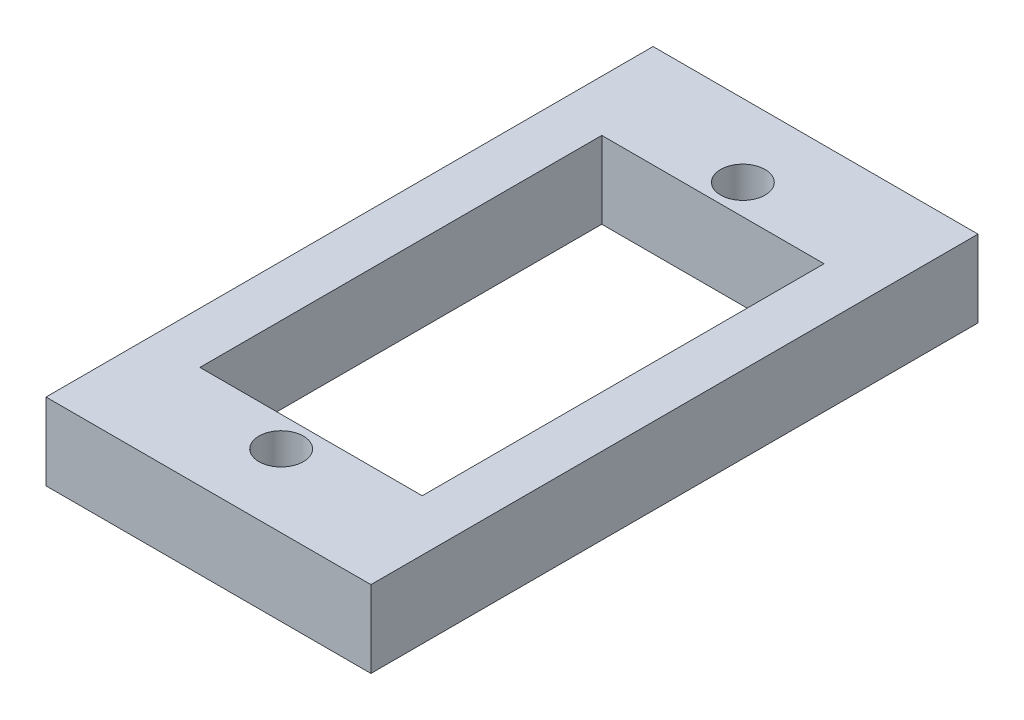
ISO-10303-21;
HEADER;
FILE_DESCRIPTION(('STEP AP214'),'2;1');
FILE_NAME('part.step','',(''),(''),'','','');
FILE_SCHEMA(('AUTOMOTIVE_DESIGN { 1 0 10303 214 1 1 1 1 }'));
ENDSEC;
DATA;
#1=APPLICATION_CONTEXT('core data for automotive mechanical design processes');
#2=APPLICATION_PROTOCOL_DEFINITION('international standard','automotive_design',2000,#1);
#3=PRODUCT_CONTEXT('',#1,'mechanical');
#4=PRODUCT('Part','Part','',(#3));
#5=PRODUCT_RELATED_PRODUCT_CATEGORY('part','',(#4));
#6=PRODUCT_DEFINITION_FORMATION('','',#4);
#7=PRODUCT_DEFINITION_CONTEXT('part definition',#1,'design');
#8=PRODUCT_DEFINITION('design','',#6,#7);
#9=PRODUCT_DEFINITION_SHAPE('','',#8);
#10=(LENGTH_UNIT() NAMED_UNIT(*) SI_UNIT(.MILLI.,.METRE.));
#11=(NAMED_UNIT(*) PLANE_ANGLE_UNIT() SI_UNIT($,.RADIAN.));
#12=(NAMED_UNIT(*) SI_UNIT($,.STERADIAN.) SOLID_ANGLE_UNIT());
#13=UNCERTAINTY_MEASURE_WITH_UNIT(LENGTH_MEASURE(1.E-05),#10,'distance_accuracy_value','');
#14=(GEOMETRIC_REPRESENTATION_CONTEXT(3) GLOBAL_UNCERTAINTY_ASSIGNED_CONTEXT((#13)) GLOBAL_UNIT_ASSIGNED_CONTEXT((#10,
#11,#12)) REPRESENTATION_CONTEXT('',''));
#15=CARTESIAN_POINT('',(0.,0.,0.));
#16=DIRECTION('',(0.,0.,1.));
#17=DIRECTION('',(1.,0.,0.));
#18=AXIS2_PLACEMENT_3D('',#15,#16,#17);
#19=CARTESIAN_POINT('',(0.,4.5,0.));
#20=DIRECTION('',(0.,-1.,0.));
#21=DIRECTION('',(0.,0.,-1.));
#22=AXIS2_PLACEMENT_3D('',#19,#20,#21);
#23=PLANE('',#22);
#24=DIRECTION('',(0.,0.,-1.));
#25=VECTOR('',#24,1.);
#26=CARTESIAN_POINT('',(9.5,4.5,17.75));
#27=LINE('',#26,#25);
#28=CARTESIAN_POINT('',(9.5,4.5,17.75));
#29=VERTEX_POINT('',#28);
#30=CARTESIAN_POINT('',(9.5,4.5,-17.75));
#31=VERTEX_POINT('',#30);
#32=EDGE_CURVE('E141',#29,#31,#27,.T.);
#33=ORIENTED_EDGE('',*,*,#32,.T.);
#34=DIRECTION('',(-1.,0.,0.));
#35=VECTOR('',#34,1.);
#36=CARTESIAN_POINT('',(-9.5,4.5,-17.75));
#37=LINE('',#36,#35);
#38=CARTESIAN_POINT('',(-9.5,4.5,-17.75));
#39=VERTEX_POINT('',#38);
#40=EDGE_CURVE('E144',#31,#39,#37,.T.);
#41=ORIENTED_EDGE('',*,*,#40,.T.);
#42=DIRECTION('',(0.,0.,1.));
#43=VECTOR('',#42,1.);
#44=CARTESIAN_POINT('',(-9.5,4.5,17.75));
#45=LINE('',#44,#43);
#46=CARTESIAN_POINT('',(-9.5,4.5,17.75));
#47=VERTEX_POINT('',#46);
#48=EDGE_CURVE('E147',#39,#47,#45,.T.);
#49=ORIENTED_EDGE('',*,*,#48,.T.);
#50=DIRECTION('',(1.,0.,0.));
#51=VECTOR('',#50,1.);
#52=CARTESIAN_POINT('',(-9.5,4.5,17.75));
#53=LINE('',#52,#51);
#54=EDGE_CURVE('E149',#47,#29,#53,.T.);
#55=ORIENTED_EDGE('',*,*,#54,.T.);
#56=EDGE_LOOP('',(#33,#41,#49,#55));
#57=FACE_BOUND('',#56,.T.);
#58=DIRECTION('',(0.,0.,-1.));
#59=VECTOR('',#58,1.);
#60=CARTESIAN_POINT('',(6.5,4.5,11.75));
#61=LINE('',#60,#59);
#62=CARTESIAN_POINT('',(6.5,4.5,11.75));
#63=VERTEX_POINT('',#62);
#64=CARTESIAN_POINT('',(6.5,4.5,-11.75));
#65=VERTEX_POINT('',#64);
#66=EDGE_CURVE('E102',#63,#65,#61,.T.);
#67=ORIENTED_EDGE('',*,*,#66,.F.);
#68=DIRECTION('',(1.,0.,0.));
#69=VECTOR('',#68,1.);
#70=CARTESIAN_POINT('',(-6.5,4.5,11.75));
#71=LINE('',#70,#69);
#72=CARTESIAN_POINT('',(-6.5,4.5,11.75));
#73=VERTEX_POINT('',#72);
#74=EDGE_CURVE('E125',#73,#63,#71,.T.);
#75=ORIENTED_EDGE('',*,*,#74,.F.);
#76=DIRECTION('',(0.,0.,1.));
#77=VECTOR('',#76,1.);
#78=CARTESIAN_POINT('',(-6.5,4.5,11.75));
#79=LINE('',#78,#77);
#80=CARTESIAN_POINT('',(-6.5,4.5,-11.75));
#81=VERTEX_POINT('',#80);
#82=EDGE_CURVE('E123',#81,#73,#79,.T.);
#83=ORIENTED_EDGE('',*,*,#82,.F.);
#84=DIRECTION('',(-1.,0.,0.));
#85=VECTOR('',#84,1.);
#86=CARTESIAN_POINT('',(-6.5,4.5,-11.75));
#87=LINE('',#86,#85);
#88=EDGE_CURVE('E110',#65,#81,#87,.T.);
#89=ORIENTED_EDGE('',*,*,#88,.F.);
#90=EDGE_LOOP('',(#67,#75,#83,#89));
#91=FACE_BOUND('',#90,.T.);
#92=CARTESIAN_POINT('',(0.,4.5,-13.5));
#93=DIRECTION('',(0.,1.,0.));
#94=DIRECTION('',(0.,0.,1.));
#95=AXIS2_PLACEMENT_3D('',#92,#93,#94);
#96=CIRCLE('',#95,1.3);
#97=CARTESIAN_POINT('',(0.,4.5,-12.2));
#98=VERTEX_POINT('',#97);
#99=EDGE_CURVE('E131',#98,#98,#96,.T.);
#100=ORIENTED_EDGE('',*,*,#99,.F.);
#101=EDGE_LOOP('',(#100));
#102=FACE_BOUND('',#101,.T.);
#103=CARTESIAN_POINT('',(0.,4.5,13.5));
#104=DIRECTION('',(0.,1.,0.));
#105=DIRECTION('',(0.,0.,1.));
#106=AXIS2_PLACEMENT_3D('',#103,#104,#105);
#107=CIRCLE('',#106,1.3);
#108=CARTESIAN_POINT('',(0.,4.5,14.8));
#109=VERTEX_POINT('',#108);
#110=EDGE_CURVE('E230',#109,#109,#107,.T.);
#111=ORIENTED_EDGE('',*,*,#110,.F.);
#112=EDGE_LOOP('',(#111));
#113=FACE_BOUND('',#112,.T.);
#114=ADVANCED_FACE('F37',(#57,#91,#102,#113),#23,.F.);
#115=CARTESIAN_POINT('',(0.,0.,0.));
#116=DIRECTION('',(0.,-1.,0.));
#117=DIRECTION('',(0.,0.,-1.));
#118=AXIS2_PLACEMENT_3D('',#115,#116,#117);
#119=PLANE('',#118);
#120=CARTESIAN_POINT('',(0.,0.,-13.5));
#121=DIRECTION('',(0.,1.,0.));
#122=DIRECTION('',(0.,0.,1.));
#123=AXIS2_PLACEMENT_3D('',#120,#121,#122);
#124=CIRCLE('',#123,1.3);
#125=CARTESIAN_POINT('',(0.,0.,-12.2));
#126=VERTEX_POINT('',#125);
#127=EDGE_CURVE('E236',#126,#126,#124,.T.);
#128=ORIENTED_EDGE('',*,*,#127,.T.);
#129=EDGE_LOOP('',(#128));
#130=FACE_BOUND('',#129,.T.);
#131=DIRECTION('',(0.,0.,-1.));
#132=VECTOR('',#131,1.);
#133=CARTESIAN_POINT('',(9.5,0.,17.75));
#134=LINE('',#133,#132);
#135=CARTESIAN_POINT('',(9.5,0.,17.75));
#136=VERTEX_POINT('',#135);
#137=CARTESIAN_POINT('',(9.5,0.,-17.75));
#138=VERTEX_POINT('',#137);
#139=EDGE_CURVE('E118',#136,#138,#134,.T.);
#140=ORIENTED_EDGE('',*,*,#139,.F.);
#141=DIRECTION('',(1.,0.,0.));
#142=VECTOR('',#141,1.);
#143=CARTESIAN_POINT('',(-9.5,0.,17.75));
#144=LINE('',#143,#142);
#145=CARTESIAN_POINT('',(-9.5,0.,17.75));
#146=VERTEX_POINT('',#145);
#147=EDGE_CURVE('E145',#146,#136,#144,.T.);
#148=ORIENTED_EDGE('',*,*,#147,.F.);
#149=DIRECTION('',(0.,0.,1.));
#150=VECTOR('',#149,1.);
#151=CARTESIAN_POINT('',(-9.5,0.,17.75));
#152=LINE('',#151,#150);
#153=CARTESIAN_POINT('',(-9.5,0.,-17.75));
#154=VERTEX_POINT('',#153);
#155=EDGE_CURVE('E156',#154,#146,#152,.T.);
#156=ORIENTED_EDGE('',*,*,#155,.F.);
#157=DIRECTION('',(-1.,0.,0.));
#158=VECTOR('',#157,1.);
#159=CARTESIAN_POINT('',(-9.5,0.,-17.75));
#160=LINE('',#159,#158);
#161=EDGE_CURVE('E154',#138,#154,#160,.T.);
#162=ORIENTED_EDGE('',*,*,#161,.F.);
#163=EDGE_LOOP('',(#140,#148,#156,#162));
#164=FACE_BOUND('',#163,.T.);
#165=DIRECTION('',(1.,0.,0.));
#166=VECTOR('',#165,1.);
#167=CARTESIAN_POINT('',(-6.5,0.,11.75));
#168=LINE('',#167,#166);
#169=CARTESIAN_POINT('',(-6.5,0.,11.75));
#170=VERTEX_POINT('',#169);
#171=CARTESIAN_POINT('',(6.5,0.,11.75));
#172=VERTEX_POINT('',#171);
#173=EDGE_CURVE('E111',#170,#172,#168,.T.);
#174=ORIENTED_EDGE('',*,*,#173,.T.);
#175=DIRECTION('',(0.,0.,-1.));
#176=VECTOR('',#175,1.);
#177=CARTESIAN_POINT('',(6.5,0.,11.75));
#178=LINE('',#177,#176);
#179=CARTESIAN_POINT('',(6.5,0.,-11.75));
#180=VERTEX_POINT('',#179);
#181=EDGE_CURVE('E60',#172,#180,#178,.T.);
#182=ORIENTED_EDGE('',*,*,#181,.T.);
#183=DIRECTION('',(-1.,0.,0.));
#184=VECTOR('',#183,1.);
#185=CARTESIAN_POINT('',(-6.5,0.,-11.75));
#186=LINE('',#185,#184);
#187=CARTESIAN_POINT('',(-6.5,0.,-11.75));
#188=VERTEX_POINT('',#187);
#189=EDGE_CURVE('E117',#180,#188,#186,.T.);
#190=ORIENTED_EDGE('',*,*,#189,.T.);
#191=DIRECTION('',(0.,0.,1.));
#192=VECTOR('',#191,1.);
#193=CARTESIAN_POINT('',(-6.5,0.,11.75));
#194=LINE('',#193,#192);
#195=EDGE_CURVE('E133',#188,#170,#194,.T.);
#196=ORIENTED_EDGE('',*,*,#195,.T.);
#197=EDGE_LOOP('',(#174,#182,#190,#196));
#198=FACE_BOUND('',#197,.T.);
#199=CARTESIAN_POINT('',(0.,0.,13.5));
#200=DIRECTION('',(0.,1.,0.));
#201=DIRECTION('',(0.,0.,1.));
#202=AXIS2_PLACEMENT_3D('',#199,#200,#201);
#203=CIRCLE('',#202,1.3);
#204=CARTESIAN_POINT('',(0.,0.,14.8));
#205=VERTEX_POINT('',#204);
#206=EDGE_CURVE('E233',#205,#205,#203,.T.);
#207=ORIENTED_EDGE('',*,*,#206,.T.);
#208=EDGE_LOOP('',(#207));
#209=FACE_BOUND('',#208,.T.);
#210=ADVANCED_FACE('F174',(#130,#164,#198,#209),#119,.T.);
#211=CARTESIAN_POINT('',(9.5,4.5,17.75));
#212=DIRECTION('',(-1.,0.,0.));
#213=DIRECTION('',(0.,0.,1.));
#214=AXIS2_PLACEMENT_3D('',#211,#212,#213);
#215=PLANE('',#214);
#216=ORIENTED_EDGE('',*,*,#139,.T.);
#217=DIRECTION('',(0.,-1.,0.));
#218=VECTOR('',#217,1.);
#219=CARTESIAN_POINT('',(9.5,4.5,-17.75));
#220=LINE('',#219,#218);
#221=EDGE_CURVE('E11',#31,#138,#220,.T.);
#222=ORIENTED_EDGE('',*,*,#221,.F.);
#223=ORIENTED_EDGE('',*,*,#32,.F.);
#224=DIRECTION('',(0.,-1.,0.));
#225=VECTOR('',#224,1.);
#226=CARTESIAN_POINT('',(9.5,4.5,17.75));
#227=LINE('',#226,#225);
#228=EDGE_CURVE('E151',#29,#136,#227,.T.);
#229=ORIENTED_EDGE('',*,*,#228,.T.);
#230=EDGE_LOOP('',(#216,#222,#223,#229));
#231=FACE_BOUND('',#230,.T.);
#232=ADVANCED_FACE('F39',(#231),#215,.F.);
#233=CARTESIAN_POINT('',(-9.5,4.5,-17.75));
#234=DIRECTION('',(0.,0.,1.));
#235=DIRECTION('',(1.,0.,0.));
#236=AXIS2_PLACEMENT_3D('',#233,#234,#235);
#237=PLANE('',#236);
#238=ORIENTED_EDGE('',*,*,#161,.T.);
#239=DIRECTION('',(0.,-1.,0.));
#240=VECTOR('',#239,1.);
#241=CARTESIAN_POINT('',(-9.5,4.5,-17.75));
#242=LINE('',#241,#240);
#243=EDGE_CURVE('E45',#39,#154,#242,.T.);
#244=ORIENTED_EDGE('',*,*,#243,.F.);
#245=ORIENTED_EDGE('',*,*,#40,.F.);
#246=ORIENTED_EDGE('',*,*,#221,.T.);
#247=EDGE_LOOP('',(#238,#244,#245,#246));
#248=FACE_BOUND('',#247,.T.);
#249=ADVANCED_FACE('F184',(#248),#237,.F.);
#250=CARTESIAN_POINT('',(-9.5,4.5,17.75));
#251=DIRECTION('',(1.,0.,0.));
#252=DIRECTION('',(0.,0.,-1.));
#253=AXIS2_PLACEMENT_3D('',#250,#251,#252);
#254=PLANE('',#253);
#255=ORIENTED_EDGE('',*,*,#155,.T.);
#256=DIRECTION('',(0.,-1.,0.));
#257=VECTOR('',#256,1.);
#258=CARTESIAN_POINT('',(-9.5,4.5,17.75));
#259=LINE('',#258,#257);
#260=EDGE_CURVE('E161',#47,#146,#259,.T.);
#261=ORIENTED_EDGE('',*,*,#260,.F.);
#262=ORIENTED_EDGE('',*,*,#48,.F.);
#263=ORIENTED_EDGE('',*,*,#243,.T.);
#264=EDGE_LOOP('',(#255,#261,#262,#263));
#265=FACE_BOUND('',#264,.T.);
#266=ADVANCED_FACE('F168',(#265),#254,.F.);
#267=CARTESIAN_POINT('',(-9.5,4.5,17.75));
#268=DIRECTION('',(0.,0.,-1.));
#269=DIRECTION('',(-1.,0.,0.));
#270=AXIS2_PLACEMENT_3D('',#267,#268,#269);
#271=PLANE('',#270);
#272=ORIENTED_EDGE('',*,*,#147,.T.);
#273=ORIENTED_EDGE('',*,*,#228,.F.);
#274=ORIENTED_EDGE('',*,*,#54,.F.);
#275=ORIENTED_EDGE('',*,*,#260,.T.);
#276=EDGE_LOOP('',(#272,#273,#274,#275));
#277=FACE_BOUND('',#276,.T.);
#278=ADVANCED_FACE('F178',(#277),#271,.F.);
#279=CARTESIAN_POINT('',(6.5,4.5,11.75));
#280=DIRECTION('',(-1.,0.,0.));
#281=DIRECTION('',(0.,0.,1.));
#282=AXIS2_PLACEMENT_3D('',#279,#280,#281);
#283=PLANE('',#282);
#284=ORIENTED_EDGE('',*,*,#181,.F.);
#285=DIRECTION('',(0.,-1.,0.));
#286=VECTOR('',#285,1.);
#287=CARTESIAN_POINT('',(6.5,4.5,11.75));
#288=LINE('',#287,#286);
#289=EDGE_CURVE('E106',#63,#172,#288,.T.);
#290=ORIENTED_EDGE('',*,*,#289,.F.);
#291=ORIENTED_EDGE('',*,*,#66,.T.);
#292=DIRECTION('',(0.,-1.,0.));
#293=VECTOR('',#292,1.);
#294=CARTESIAN_POINT('',(6.5,4.5,-11.75));
#295=LINE('',#294,#293);
#296=EDGE_CURVE('E105',#65,#180,#295,.T.);
#297=ORIENTED_EDGE('',*,*,#296,.T.);
#298=EDGE_LOOP('',(#284,#290,#291,#297));
#299=FACE_BOUND('',#298,.T.);
#300=ADVANCED_FACE('F104',(#299),#283,.T.);
#301=CARTESIAN_POINT('',(-6.5,4.5,-11.75));
#302=DIRECTION('',(0.,0.,1.));
#303=DIRECTION('',(1.,0.,0.));
#304=AXIS2_PLACEMENT_3D('',#301,#302,#303);
#305=PLANE('',#304);
#306=ORIENTED_EDGE('',*,*,#189,.F.);
#307=ORIENTED_EDGE('',*,*,#296,.F.);
#308=ORIENTED_EDGE('',*,*,#88,.T.);
#309=DIRECTION('',(0.,-1.,0.));
#310=VECTOR('',#309,1.);
#311=CARTESIAN_POINT('',(-6.5,4.5,-11.75));
#312=LINE('',#311,#310);
#313=EDGE_CURVE('E119',#81,#188,#312,.T.);
#314=ORIENTED_EDGE('',*,*,#313,.T.);
#315=EDGE_LOOP('',(#306,#307,#308,#314));
#316=FACE_BOUND('',#315,.T.);
#317=ADVANCED_FACE('F114',(#316),#305,.T.);
#318=CARTESIAN_POINT('',(-6.5,4.5,11.75));
#319=DIRECTION('',(1.,0.,0.));
#320=DIRECTION('',(0.,0.,-1.));
#321=AXIS2_PLACEMENT_3D('',#318,#319,#320);
#322=PLANE('',#321);
#323=ORIENTED_EDGE('',*,*,#195,.F.);
#324=ORIENTED_EDGE('',*,*,#313,.F.);
#325=ORIENTED_EDGE('',*,*,#82,.T.);
#326=DIRECTION('',(0.,-1.,0.));
#327=VECTOR('',#326,1.);
#328=CARTESIAN_POINT('',(-6.5,4.5,11.75));
#329=LINE('',#328,#327);
#330=EDGE_CURVE('E52',#73,#170,#329,.T.);
#331=ORIENTED_EDGE('',*,*,#330,.T.);
#332=EDGE_LOOP('',(#323,#324,#325,#331));
#333=FACE_BOUND('',#332,.T.);
#334=ADVANCED_FACE('F208',(#333),#322,.T.);
#335=CARTESIAN_POINT('',(-6.5,4.5,11.75));
#336=DIRECTION('',(0.,0.,-1.));
#337=DIRECTION('',(-1.,0.,0.));
#338=AXIS2_PLACEMENT_3D('',#335,#336,#337);
#339=PLANE('',#338);
#340=ORIENTED_EDGE('',*,*,#173,.F.);
#341=ORIENTED_EDGE('',*,*,#330,.F.);
#342=ORIENTED_EDGE('',*,*,#74,.T.);
#343=ORIENTED_EDGE('',*,*,#289,.T.);
#344=EDGE_LOOP('',(#340,#341,#342,#343));
#345=FACE_BOUND('',#344,.T.);
#346=ADVANCED_FACE('F212',(#345),#339,.T.);
#347=CARTESIAN_POINT('',(0.,4.5,-13.5));
#348=DIRECTION('',(0.,-1.,0.));
#349=DIRECTION('',(0.,0.,-1.));
#350=AXIS2_PLACEMENT_3D('',#347,#348,#349);
#351=CYLINDRICAL_SURFACE('',#350,1.3);
#352=ORIENTED_EDGE('',*,*,#99,.T.);
#353=EDGE_LOOP('',(#352));
#354=FACE_BOUND('',#353,.T.);
#355=ORIENTED_EDGE('',*,*,#127,.F.);
#356=EDGE_LOOP('',(#355));
#357=FACE_BOUND('',#356,.T.);
#358=ADVANCED_FACE('F218',(#354,#357),#351,.F.);
#359=CARTESIAN_POINT('',(0.,4.5,13.5));
#360=DIRECTION('',(0.,-1.,0.));
#361=DIRECTION('',(0.,0.,-1.));
#362=AXIS2_PLACEMENT_3D('',#359,#360,#361);
#363=CYLINDRICAL_SURFACE('',#362,1.3);
#364=ORIENTED_EDGE('',*,*,#110,.T.);
#365=EDGE_LOOP('',(#364));
#366=FACE_BOUND('',#365,.T.);
#367=ORIENTED_EDGE('',*,*,#206,.F.);
#368=EDGE_LOOP('',(#367));
#369=FACE_BOUND('',#368,.T.);
#370=ADVANCED_FACE('F221',(#366,#369),#363,.F.);
#371=CLOSED_SHELL('',(#114,#210,#232,#249,#266,#278,#300,#317,#334,#346,#358,#370));
#372=MANIFOLD_SOLID_BREP('B2',#371);
#373=ADVANCED_BREP_SHAPE_REPRESENTATION('',(#18,#372),#14);
#374=SHAPE_DEFINITION_REPRESENTATION(#9,#373);
ENDSEC;
END-ISO-10303-21;
